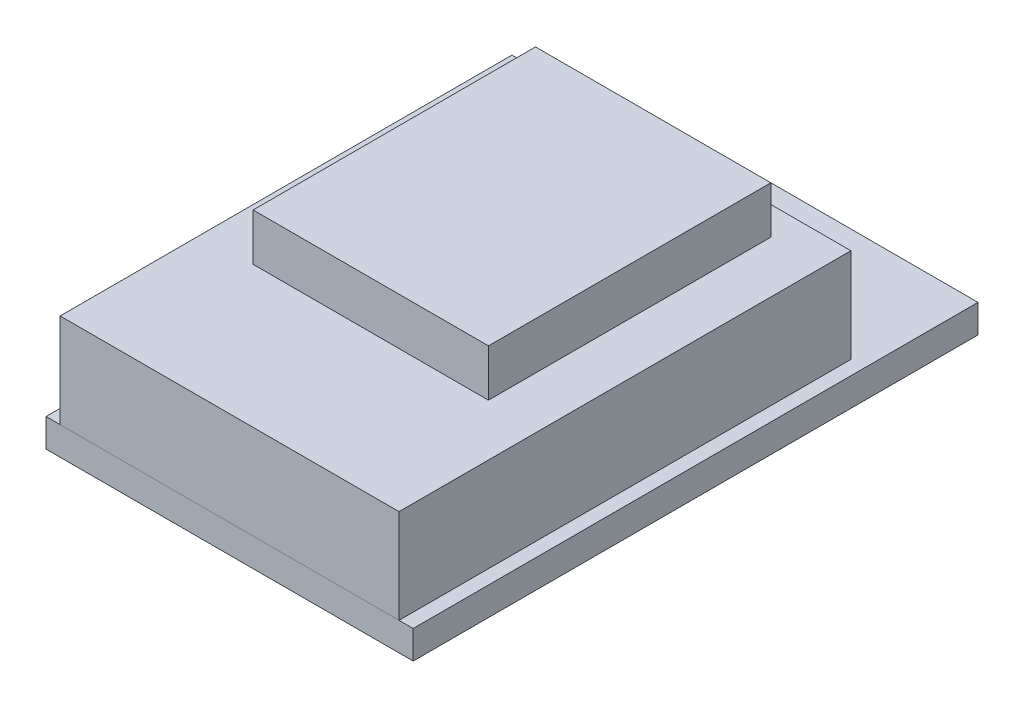
ISO-10303-21;
HEADER;
FILE_DESCRIPTION(('STEP AP214'),'2;1');
FILE_NAME('part.step','',(''),(''),'','','');
FILE_SCHEMA(('AUTOMOTIVE_DESIGN { 1 0 10303 214 1 1 1 1 }'));
ENDSEC;
DATA;
#1=APPLICATION_CONTEXT('core data for automotive mechanical design processes');
#2=APPLICATION_PROTOCOL_DEFINITION('international standard','automotive_design',2000,#1);
#3=PRODUCT_CONTEXT('',#1,'mechanical');
#4=PRODUCT('Part','Part','',(#3));
#5=PRODUCT_RELATED_PRODUCT_CATEGORY('part','',(#4));
#6=PRODUCT_DEFINITION_FORMATION('','',#4);
#7=PRODUCT_DEFINITION_CONTEXT('part definition',#1,'design');
#8=PRODUCT_DEFINITION('design','',#6,#7);
#9=PRODUCT_DEFINITION_SHAPE('','',#8);
#10=(LENGTH_UNIT() NAMED_UNIT(*) SI_UNIT(.MILLI.,.METRE.));
#11=(NAMED_UNIT(*) PLANE_ANGLE_UNIT() SI_UNIT($,.RADIAN.));
#12=(NAMED_UNIT(*) SI_UNIT($,.STERADIAN.) SOLID_ANGLE_UNIT());
#13=UNCERTAINTY_MEASURE_WITH_UNIT(LENGTH_MEASURE(1.E-05),#10,'distance_accuracy_value','');
#14=(GEOMETRIC_REPRESENTATION_CONTEXT(3) GLOBAL_UNCERTAINTY_ASSIGNED_CONTEXT((#13)) GLOBAL_UNIT_ASSIGNED_CONTEXT((#10,
#11,#12)) REPRESENTATION_CONTEXT('',''));
#15=CARTESIAN_POINT('',(0.,0.,0.));
#16=DIRECTION('',(0.,0.,1.));
#17=DIRECTION('',(1.,0.,0.));
#18=AXIS2_PLACEMENT_3D('',#15,#16,#17);
#19=CARTESIAN_POINT('',(-6.25,9.,7.5));
#20=DIRECTION('',(1.,0.,0.));
#21=DIRECTION('',(0.,0.,-1.));
#22=AXIS2_PLACEMENT_3D('',#19,#20,#21);
#23=PLANE('',#22);
#24=DIRECTION('',(0.,0.,1.));
#25=VECTOR('',#24,1.);
#26=CARTESIAN_POINT('',(-6.25,6.5,7.5));
#27=LINE('',#26,#25);
#28=CARTESIAN_POINT('',(-6.25,6.5,-7.5));
#29=VERTEX_POINT('',#28);
#30=CARTESIAN_POINT('',(-6.25,6.5,7.5));
#31=VERTEX_POINT('',#30);
#32=EDGE_CURVE('E109',#29,#31,#27,.T.);
#33=ORIENTED_EDGE('',*,*,#32,.T.);
#34=DIRECTION('',(0.,-1.,0.));
#35=VECTOR('',#34,1.);
#36=CARTESIAN_POINT('',(-6.25,9.,7.5));
#37=LINE('',#36,#35);
#38=CARTESIAN_POINT('',(-6.25,9.,7.5));
#39=VERTEX_POINT('',#38);
#40=EDGE_CURVE('E12',#39,#31,#37,.T.);
#41=ORIENTED_EDGE('',*,*,#40,.F.);
#42=DIRECTION('',(0.,0.,1.));
#43=VECTOR('',#42,1.);
#44=CARTESIAN_POINT('',(-6.25,9.,7.5));
#45=LINE('',#44,#43);
#46=CARTESIAN_POINT('',(-6.25,9.,-7.5));
#47=VERTEX_POINT('',#46);
#48=EDGE_CURVE('E97',#47,#39,#45,.T.);
#49=ORIENTED_EDGE('',*,*,#48,.F.);
#50=DIRECTION('',(0.,-1.,0.));
#51=VECTOR('',#50,1.);
#52=CARTESIAN_POINT('',(-6.25,9.,-7.5));
#53=LINE('',#52,#51);
#54=EDGE_CURVE('E105',#47,#29,#53,.T.);
#55=ORIENTED_EDGE('',*,*,#54,.T.);
#56=EDGE_LOOP('',(#33,#41,#49,#55));
#57=FACE_BOUND('',#56,.T.);
#58=ADVANCED_FACE('F46',(#57),#23,.F.);
#59=CARTESIAN_POINT('',(6.25,9.,7.5));
#60=DIRECTION('',(0.,0.,-1.));
#61=DIRECTION('',(-1.,0.,0.));
#62=AXIS2_PLACEMENT_3D('',#59,#60,#61);
#63=PLANE('',#62);
#64=DIRECTION('',(1.,0.,0.));
#65=VECTOR('',#64,1.);
#66=CARTESIAN_POINT('',(6.25,6.5,7.5));
#67=LINE('',#66,#65);
#68=CARTESIAN_POINT('',(6.25,6.5,7.5));
#69=VERTEX_POINT('',#68);
#70=EDGE_CURVE('E101',#31,#69,#67,.T.);
#71=ORIENTED_EDGE('',*,*,#70,.T.);
#72=DIRECTION('',(0.,-1.,0.));
#73=VECTOR('',#72,1.);
#74=CARTESIAN_POINT('',(6.25,9.,7.5));
#75=LINE('',#74,#73);
#76=CARTESIAN_POINT('',(6.25,9.,7.5));
#77=VERTEX_POINT('',#76);
#78=EDGE_CURVE('E54',#77,#69,#75,.T.);
#79=ORIENTED_EDGE('',*,*,#78,.F.);
#80=DIRECTION('',(1.,0.,0.));
#81=VECTOR('',#80,1.);
#82=CARTESIAN_POINT('',(6.25,9.,7.5));
#83=LINE('',#82,#81);
#84=EDGE_CURVE('E92',#39,#77,#83,.T.);
#85=ORIENTED_EDGE('',*,*,#84,.F.);
#86=ORIENTED_EDGE('',*,*,#40,.T.);
#87=EDGE_LOOP('',(#71,#79,#85,#86));
#88=FACE_BOUND('',#87,.T.);
#89=ADVANCED_FACE('F100',(#88),#63,.F.);
#90=CARTESIAN_POINT('',(6.25,9.,7.5));
#91=DIRECTION('',(-1.,0.,0.));
#92=DIRECTION('',(0.,0.,1.));
#93=AXIS2_PLACEMENT_3D('',#90,#91,#92);
#94=PLANE('',#93);
#95=DIRECTION('',(0.,0.,-1.));
#96=VECTOR('',#95,1.);
#97=CARTESIAN_POINT('',(6.25,6.5,7.5));
#98=LINE('',#97,#96);
#99=CARTESIAN_POINT('',(6.25,6.5,-7.5));
#100=VERTEX_POINT('',#99);
#101=EDGE_CURVE('E79',#69,#100,#98,.T.);
#102=ORIENTED_EDGE('',*,*,#101,.T.);
#103=DIRECTION('',(0.,-1.,0.));
#104=VECTOR('',#103,1.);
#105=CARTESIAN_POINT('',(6.25,9.,-7.5));
#106=LINE('',#105,#104);
#107=CARTESIAN_POINT('',(6.25,9.,-7.5));
#108=VERTEX_POINT('',#107);
#109=EDGE_CURVE('E102',#108,#100,#106,.T.);
#110=ORIENTED_EDGE('',*,*,#109,.F.);
#111=DIRECTION('',(0.,0.,-1.));
#112=VECTOR('',#111,1.);
#113=CARTESIAN_POINT('',(6.25,9.,7.5));
#114=LINE('',#113,#112);
#115=EDGE_CURVE('E95',#77,#108,#114,.T.);
#116=ORIENTED_EDGE('',*,*,#115,.F.);
#117=ORIENTED_EDGE('',*,*,#78,.T.);
#118=EDGE_LOOP('',(#102,#110,#116,#117));
#119=FACE_BOUND('',#118,.T.);
#120=ADVANCED_FACE('F103',(#119),#94,.F.);
#121=CARTESIAN_POINT('',(6.25,9.,-7.5));
#122=DIRECTION('',(0.,0.,1.));
#123=DIRECTION('',(1.,0.,0.));
#124=AXIS2_PLACEMENT_3D('',#121,#122,#123);
#125=PLANE('',#124);
#126=DIRECTION('',(-1.,0.,0.));
#127=VECTOR('',#126,1.);
#128=CARTESIAN_POINT('',(6.25,6.5,-7.5));
#129=LINE('',#128,#127);
#130=EDGE_CURVE('E85',#100,#29,#129,.T.);
#131=ORIENTED_EDGE('',*,*,#130,.T.);
#132=ORIENTED_EDGE('',*,*,#54,.F.);
#133=DIRECTION('',(-1.,0.,0.));
#134=VECTOR('',#133,1.);
#135=CARTESIAN_POINT('',(6.25,9.,-7.5));
#136=LINE('',#135,#134);
#137=EDGE_CURVE('E62',#108,#47,#136,.T.);
#138=ORIENTED_EDGE('',*,*,#137,.F.);
#139=ORIENTED_EDGE('',*,*,#109,.T.);
#140=EDGE_LOOP('',(#131,#132,#138,#139));
#141=FACE_BOUND('',#140,.T.);
#142=ADVANCED_FACE('F116',(#141),#125,.F.);
#143=CARTESIAN_POINT('',(0.,9.,0.));
#144=DIRECTION('',(0.,1.,0.));
#145=DIRECTION('',(0.,0.,1.));
#146=AXIS2_PLACEMENT_3D('',#143,#144,#145);
#147=PLANE('',#146);
#148=ORIENTED_EDGE('',*,*,#48,.T.);
#149=ORIENTED_EDGE('',*,*,#84,.T.);
#150=ORIENTED_EDGE('',*,*,#115,.T.);
#151=ORIENTED_EDGE('',*,*,#137,.T.);
#152=EDGE_LOOP('',(#148,#149,#150,#151));
#153=FACE_BOUND('',#152,.T.);
#154=ADVANCED_FACE('F93',(#153),#147,.T.);
#155=CARTESIAN_POINT('',(0.,6.5,0.));
#156=DIRECTION('',(0.,1.,0.));
#157=DIRECTION('',(0.,0.,1.));
#158=AXIS2_PLACEMENT_3D('',#155,#156,#157);
#159=PLANE('',#158);
#160=ORIENTED_EDGE('',*,*,#32,.F.);
#161=ORIENTED_EDGE('',*,*,#130,.F.);
#162=ORIENTED_EDGE('',*,*,#101,.F.);
#163=ORIENTED_EDGE('',*,*,#70,.F.);
#164=EDGE_LOOP('',(#160,#161,#162,#163));
#165=FACE_BOUND('',#164,.T.);
#166=ADVANCED_FACE('F119',(#165),#159,.F.);
#167=CLOSED_SHELL('',(#58,#89,#120,#142,#154,#166));
#168=MANIFOLD_SOLID_BREP('B2',#167);
#169=CARTESIAN_POINT('',(9.,6.5,-9.));
#170=DIRECTION('',(-1.,0.,0.));
#171=DIRECTION('',(0.,0.,1.));
#172=AXIS2_PLACEMENT_3D('',#169,#170,#171);
#173=PLANE('',#172);
#174=DIRECTION('',(0.,0.,-1.));
#175=VECTOR('',#174,1.);
#176=CARTESIAN_POINT('',(9.,1.5,-9.));
#177=LINE('',#176,#175);
#178=CARTESIAN_POINT('',(9.00000000000001,1.5,15.));
#179=VERTEX_POINT('',#178);
#180=CARTESIAN_POINT('',(9.,1.5,-9.));
#181=VERTEX_POINT('',#180);
#182=EDGE_CURVE('E243',#179,#181,#177,.T.);
#183=ORIENTED_EDGE('',*,*,#182,.T.);
#184=DIRECTION('',(0.,-1.,0.));
#185=VECTOR('',#184,1.);
#186=CARTESIAN_POINT('',(9.,6.5,-9.));
#187=LINE('',#186,#185);
#188=CARTESIAN_POINT('',(9.,6.5,-9.));
#189=VERTEX_POINT('',#188);
#190=EDGE_CURVE('E44',#189,#181,#187,.T.);
#191=ORIENTED_EDGE('',*,*,#190,.F.);
#192=DIRECTION('',(0.,0.,-1.));
#193=VECTOR('',#192,1.);
#194=CARTESIAN_POINT('',(9.,6.5,-9.));
#195=LINE('',#194,#193);
#196=CARTESIAN_POINT('',(9.00000000000001,6.5,15.));
#197=VERTEX_POINT('',#196);
#198=EDGE_CURVE('E231',#197,#189,#195,.T.);
#199=ORIENTED_EDGE('',*,*,#198,.F.);
#200=DIRECTION('',(0.,-1.,0.));
#201=VECTOR('',#200,1.);
#202=CARTESIAN_POINT('',(9.00000000000001,6.5,15.));
#203=LINE('',#202,#201);
#204=EDGE_CURVE('E239',#197,#179,#203,.T.);
#205=ORIENTED_EDGE('',*,*,#204,.T.);
#206=EDGE_LOOP('',(#183,#191,#199,#205));
#207=FACE_BOUND('',#206,.T.);
#208=ADVANCED_FACE('F180',(#207),#173,.F.);
#209=CARTESIAN_POINT('',(-9.,6.5,-9.));
#210=DIRECTION('',(0.,0.,1.));
#211=DIRECTION('',(1.,0.,0.));
#212=AXIS2_PLACEMENT_3D('',#209,#210,#211);
#213=PLANE('',#212);
#214=DIRECTION('',(-1.,0.,0.));
#215=VECTOR('',#214,1.);
#216=CARTESIAN_POINT('',(-9.,1.5,-9.));
#217=LINE('',#216,#215);
#218=CARTESIAN_POINT('',(-9.,1.5,-9.));
#219=VERTEX_POINT('',#218);
#220=EDGE_CURVE('E235',#181,#219,#217,.T.);
#221=ORIENTED_EDGE('',*,*,#220,.T.);
#222=DIRECTION('',(0.,-1.,0.));
#223=VECTOR('',#222,1.);
#224=CARTESIAN_POINT('',(-9.,6.5,-9.));
#225=LINE('',#224,#223);
#226=CARTESIAN_POINT('',(-9.,6.5,-9.));
#227=VERTEX_POINT('',#226);
#228=EDGE_CURVE('E188',#227,#219,#225,.T.);
#229=ORIENTED_EDGE('',*,*,#228,.F.);
#230=DIRECTION('',(-1.,0.,0.));
#231=VECTOR('',#230,1.);
#232=CARTESIAN_POINT('',(-9.,6.5,-9.));
#233=LINE('',#232,#231);
#234=EDGE_CURVE('E226',#189,#227,#233,.T.);
#235=ORIENTED_EDGE('',*,*,#234,.F.);
#236=ORIENTED_EDGE('',*,*,#190,.T.);
#237=EDGE_LOOP('',(#221,#229,#235,#236));
#238=FACE_BOUND('',#237,.T.);
#239=ADVANCED_FACE('F234',(#238),#213,.F.);
#240=CARTESIAN_POINT('',(-9.,6.5,-9.));
#241=DIRECTION('',(1.,0.,0.));
#242=DIRECTION('',(0.,0.,-1.));
#243=AXIS2_PLACEMENT_3D('',#240,#241,#242);
#244=PLANE('',#243);
#245=DIRECTION('',(0.,0.,1.));
#246=VECTOR('',#245,1.);
#247=CARTESIAN_POINT('',(-9.,1.5,-9.));
#248=LINE('',#247,#246);
#249=CARTESIAN_POINT('',(-9.,1.5,15.));
#250=VERTEX_POINT('',#249);
#251=EDGE_CURVE('E213',#219,#250,#248,.T.);
#252=ORIENTED_EDGE('',*,*,#251,.T.);
#253=DIRECTION('',(0.,-1.,0.));
#254=VECTOR('',#253,1.);
#255=CARTESIAN_POINT('',(-9.,6.5,15.));
#256=LINE('',#255,#254);
#257=CARTESIAN_POINT('',(-9.,6.5,15.));
#258=VERTEX_POINT('',#257);
#259=EDGE_CURVE('E236',#258,#250,#256,.T.);
#260=ORIENTED_EDGE('',*,*,#259,.F.);
#261=DIRECTION('',(0.,0.,1.));
#262=VECTOR('',#261,1.);
#263=CARTESIAN_POINT('',(-9.,6.5,-9.));
#264=LINE('',#263,#262);
#265=EDGE_CURVE('E229',#227,#258,#264,.T.);
#266=ORIENTED_EDGE('',*,*,#265,.F.);
#267=ORIENTED_EDGE('',*,*,#228,.T.);
#268=EDGE_LOOP('',(#252,#260,#266,#267));
#269=FACE_BOUND('',#268,.T.);
#270=ADVANCED_FACE('F237',(#269),#244,.F.);
#271=CARTESIAN_POINT('',(-9.,6.5,15.));
#272=DIRECTION('',(0.,0.,-1.));
#273=DIRECTION('',(-1.,0.,0.));
#274=AXIS2_PLACEMENT_3D('',#271,#272,#273);
#275=PLANE('',#274);
#276=DIRECTION('',(1.,0.,0.));
#277=VECTOR('',#276,1.);
#278=CARTESIAN_POINT('',(-9.,1.5,15.));
#279=LINE('',#278,#277);
#280=EDGE_CURVE('E219',#250,#179,#279,.T.);
#281=ORIENTED_EDGE('',*,*,#280,.T.);
#282=ORIENTED_EDGE('',*,*,#204,.F.);
#283=DIRECTION('',(1.,0.,0.));
#284=VECTOR('',#283,1.);
#285=CARTESIAN_POINT('',(-9.,6.5,15.));
#286=LINE('',#285,#284);
#287=EDGE_CURVE('E196',#258,#197,#286,.T.);
#288=ORIENTED_EDGE('',*,*,#287,.F.);
#289=ORIENTED_EDGE('',*,*,#259,.T.);
#290=EDGE_LOOP('',(#281,#282,#288,#289));
#291=FACE_BOUND('',#290,.T.);
#292=ADVANCED_FACE('F250',(#291),#275,.F.);
#293=CARTESIAN_POINT('',(0.,6.5,0.));
#294=DIRECTION('',(0.,1.,0.));
#295=DIRECTION('',(0.,0.,1.));
#296=AXIS2_PLACEMENT_3D('',#293,#294,#295);
#297=PLANE('',#296);
#298=ORIENTED_EDGE('',*,*,#198,.T.);
#299=ORIENTED_EDGE('',*,*,#234,.T.);
#300=ORIENTED_EDGE('',*,*,#265,.T.);
#301=ORIENTED_EDGE('',*,*,#287,.T.);
#302=EDGE_LOOP('',(#298,#299,#300,#301));
#303=FACE_BOUND('',#302,.T.);
#304=ADVANCED_FACE('F227',(#303),#297,.T.);
#305=CARTESIAN_POINT('',(0.,1.5,0.));
#306=DIRECTION('',(0.,1.,0.));
#307=DIRECTION('',(0.,0.,1.));
#308=AXIS2_PLACEMENT_3D('',#305,#306,#307);
#309=PLANE('',#308);
#310=ORIENTED_EDGE('',*,*,#182,.F.);
#311=ORIENTED_EDGE('',*,*,#280,.F.);
#312=ORIENTED_EDGE('',*,*,#251,.F.);
#313=ORIENTED_EDGE('',*,*,#220,.F.);
#314=EDGE_LOOP('',(#310,#311,#312,#313));
#315=FACE_BOUND('',#314,.T.);
#316=ADVANCED_FACE('F253',(#315),#309,.F.);
#317=CLOSED_SHELL('',(#208,#239,#270,#292,#304,#316));
#318=MANIFOLD_SOLID_BREP('B6',#317);
#319=CARTESIAN_POINT('',(5.08,-2.54,11.19));
#320=DIRECTION('',(0.,0.,-1.));
#321=DIRECTION('',(-1.,0.,0.));
#322=AXIS2_PLACEMENT_3D('',#319,#320,#321);
#323=PLANE('',#322);
#324=DIRECTION('',(-1.,0.,0.));
#325=VECTOR('',#324,1.);
#326=CARTESIAN_POINT('',(5.08,0.,11.19));
#327=LINE('',#326,#325);
#328=CARTESIAN_POINT('',(5.08,0.,11.19));
#329=VERTEX_POINT('',#328);
#330=CARTESIAN_POINT('',(2.54,0.,11.19));
#331=VERTEX_POINT('',#330);
#332=EDGE_CURVE('E377',#329,#331,#327,.T.);
#333=ORIENTED_EDGE('',*,*,#332,.T.);
#334=DIRECTION('',(0.,1.,0.));
#335=VECTOR('',#334,1.);
#336=CARTESIAN_POINT('',(2.54,-2.54,11.19));
#337=LINE('',#336,#335);
#338=CARTESIAN_POINT('',(2.54,-2.54,11.19));
#339=VERTEX_POINT('',#338);
#340=EDGE_CURVE('E178',#339,#331,#337,.T.);
#341=ORIENTED_EDGE('',*,*,#340,.F.);
#342=DIRECTION('',(-1.,0.,0.));
#343=VECTOR('',#342,1.);
#344=CARTESIAN_POINT('',(5.08,-2.54,11.19));
#345=LINE('',#344,#343);
#346=CARTESIAN_POINT('',(5.08,-2.54,11.19));
#347=VERTEX_POINT('',#346);
#348=EDGE_CURVE('E365',#347,#339,#345,.T.);
#349=ORIENTED_EDGE('',*,*,#348,.F.);
#350=DIRECTION('',(0.,1.,0.));
#351=VECTOR('',#350,1.);
#352=CARTESIAN_POINT('',(5.08,-2.54,11.19));
#353=LINE('',#352,#351);
#354=EDGE_CURVE('E373',#347,#329,#353,.T.);
#355=ORIENTED_EDGE('',*,*,#354,.T.);
#356=EDGE_LOOP('',(#333,#341,#349,#355));
#357=FACE_BOUND('',#356,.T.);
#358=ADVANCED_FACE('F314',(#357),#323,.F.);
#359=CARTESIAN_POINT('',(2.54,-2.54,11.19));
#360=DIRECTION('',(1.,0.,0.));
#361=DIRECTION('',(0.,0.,-1.));
#362=AXIS2_PLACEMENT_3D('',#359,#360,#361);
#363=PLANE('',#362);
#364=DIRECTION('',(0.,0.,-1.));
#365=VECTOR('',#364,1.);
#366=CARTESIAN_POINT('',(2.54,0.,11.19));
#367=LINE('',#366,#365);
#368=CARTESIAN_POINT('',(2.54,0.,-9.12999999999998));
#369=VERTEX_POINT('',#368);
#370=EDGE_CURVE('E369',#331,#369,#367,.T.);
#371=ORIENTED_EDGE('',*,*,#370,.T.);
#372=DIRECTION('',(0.,1.,0.));
#373=VECTOR('',#372,1.);
#374=CARTESIAN_POINT('',(2.54,-2.54,-9.12999999999998));
#375=LINE('',#374,#373);
#376=CARTESIAN_POINT('',(2.54,-2.54,-9.12999999999998));
#377=VERTEX_POINT('',#376);
#378=EDGE_CURVE('E322',#377,#369,#375,.T.);
#379=ORIENTED_EDGE('',*,*,#378,.F.);
#380=DIRECTION('',(0.,0.,-1.));
#381=VECTOR('',#380,1.);
#382=CARTESIAN_POINT('',(2.54,-2.54,11.19));
#383=LINE('',#382,#381);
#384=EDGE_CURVE('E360',#339,#377,#383,.T.);
#385=ORIENTED_EDGE('',*,*,#384,.F.);
#386=ORIENTED_EDGE('',*,*,#340,.T.);
#387=EDGE_LOOP('',(#371,#379,#385,#386));
#388=FACE_BOUND('',#387,.T.);
#389=ADVANCED_FACE('F368',(#388),#363,.F.);
#390=CARTESIAN_POINT('',(5.08,-2.54,-9.12999999999998));
#391=DIRECTION('',(0.,0.,1.));
#392=DIRECTION('',(1.,0.,0.));
#393=AXIS2_PLACEMENT_3D('',#390,#391,#392);
#394=PLANE('',#393);
#395=DIRECTION('',(1.,0.,0.));
#396=VECTOR('',#395,1.);
#397=CARTESIAN_POINT('',(5.08,0.,-9.12999999999998));
#398=LINE('',#397,#396);
#399=CARTESIAN_POINT('',(5.08,0.,-9.12999999999998));
#400=VERTEX_POINT('',#399);
#401=EDGE_CURVE('E347',#369,#400,#398,.T.);
#402=ORIENTED_EDGE('',*,*,#401,.T.);
#403=DIRECTION('',(0.,1.,0.));
#404=VECTOR('',#403,1.);
#405=CARTESIAN_POINT('',(5.08,-2.54,-9.12999999999998));
#406=LINE('',#405,#404);
#407=CARTESIAN_POINT('',(5.08,-2.54,-9.12999999999998));
#408=VERTEX_POINT('',#407);
#409=EDGE_CURVE('E370',#408,#400,#406,.T.);
#410=ORIENTED_EDGE('',*,*,#409,.F.);
#411=DIRECTION('',(1.,0.,0.));
#412=VECTOR('',#411,1.);
#413=CARTESIAN_POINT('',(5.08,-2.54,-9.12999999999998));
#414=LINE('',#413,#412);
#415=EDGE_CURVE('E363',#377,#408,#414,.T.);
#416=ORIENTED_EDGE('',*,*,#415,.F.);
#417=ORIENTED_EDGE('',*,*,#378,.T.);
#418=EDGE_LOOP('',(#402,#410,#416,#417));
#419=FACE_BOUND('',#418,.T.);
#420=ADVANCED_FACE('F371',(#419),#394,.F.);
#421=CARTESIAN_POINT('',(5.08,-2.54,11.19));
#422=DIRECTION('',(-1.,0.,0.));
#423=DIRECTION('',(0.,0.,1.));
#424=AXIS2_PLACEMENT_3D('',#421,#422,#423);
#425=PLANE('',#424);
#426=DIRECTION('',(0.,0.,1.));
#427=VECTOR('',#426,1.);
#428=CARTESIAN_POINT('',(5.08,0.,11.19));
#429=LINE('',#428,#427);
#430=EDGE_CURVE('E353',#400,#329,#429,.T.);
#431=ORIENTED_EDGE('',*,*,#430,.T.);
#432=ORIENTED_EDGE('',*,*,#354,.F.);
#433=DIRECTION('',(0.,0.,1.));
#434=VECTOR('',#433,1.);
#435=CARTESIAN_POINT('',(5.08,-2.54,11.19));
#436=LINE('',#435,#434);
#437=EDGE_CURVE('E330',#408,#347,#436,.T.);
#438=ORIENTED_EDGE('',*,*,#437,.F.);
#439=ORIENTED_EDGE('',*,*,#409,.T.);
#440=EDGE_LOOP('',(#431,#432,#438,#439));
#441=FACE_BOUND('',#440,.T.);
#442=ADVANCED_FACE('F384',(#441),#425,.F.);
#443=CARTESIAN_POINT('',(0.,-2.54,0.));
#444=DIRECTION('',(0.,-1.,0.));
#445=DIRECTION('',(0.,0.,-1.));
#446=AXIS2_PLACEMENT_3D('',#443,#444,#445);
#447=PLANE('',#446);
#448=ORIENTED_EDGE('',*,*,#348,.T.);
#449=ORIENTED_EDGE('',*,*,#384,.T.);
#450=ORIENTED_EDGE('',*,*,#415,.T.);
#451=ORIENTED_EDGE('',*,*,#437,.T.);
#452=EDGE_LOOP('',(#448,#449,#450,#451));
#453=FACE_BOUND('',#452,.T.);
#454=ADVANCED_FACE('F361',(#453),#447,.T.);
#455=CARTESIAN_POINT('',(0.,0.,0.));
#456=DIRECTION('',(0.,-1.,0.));
#457=DIRECTION('',(0.,0.,-1.));
#458=AXIS2_PLACEMENT_3D('',#455,#456,#457);
#459=PLANE('',#458);
#460=ORIENTED_EDGE('',*,*,#332,.F.);
#461=ORIENTED_EDGE('',*,*,#430,.F.);
#462=ORIENTED_EDGE('',*,*,#401,.F.);
#463=ORIENTED_EDGE('',*,*,#370,.F.);
#464=EDGE_LOOP('',(#460,#461,#462,#463));
#465=FACE_BOUND('',#464,.T.);
#466=ADVANCED_FACE('F387',(#465),#459,.F.);
#467=CLOSED_SHELL('',(#358,#389,#420,#442,#454,#466));
#468=MANIFOLD_SOLID_BREP('B38',#467);
#469=CARTESIAN_POINT('',(-5.08,-2.54,11.19));
#470=DIRECTION('',(1.,0.,0.));
#471=DIRECTION('',(0.,0.,-1.));
#472=AXIS2_PLACEMENT_3D('',#469,#470,#471);
#473=PLANE('',#472);
#474=DIRECTION('',(0.,0.,-1.));
#475=VECTOR('',#474,1.);
#476=CARTESIAN_POINT('',(-5.08,0.,11.19));
#477=LINE('',#476,#475);
#478=CARTESIAN_POINT('',(-5.08,0.,11.19));
#479=VERTEX_POINT('',#478);
#480=CARTESIAN_POINT('',(-5.08,0.,-9.13));
#481=VERTEX_POINT('',#480);
#482=EDGE_CURVE('E510',#479,#481,#477,.T.);
#483=ORIENTED_EDGE('',*,*,#482,.T.);
#484=DIRECTION('',(0.,1.,0.));
#485=VECTOR('',#484,1.);
#486=CARTESIAN_POINT('',(-5.08,-2.54,-9.13));
#487=LINE('',#486,#485);
#488=CARTESIAN_POINT('',(-5.08,-2.54,-9.13));
#489=VERTEX_POINT('',#488);
#490=EDGE_CURVE('E312',#489,#481,#487,.T.);
#491=ORIENTED_EDGE('',*,*,#490,.F.);
#492=DIRECTION('',(0.,0.,-1.));
#493=VECTOR('',#492,1.);
#494=CARTESIAN_POINT('',(-5.08,-2.54,11.19));
#495=LINE('',#494,#493);
#496=CARTESIAN_POINT('',(-5.08,-2.54,11.19));
#497=VERTEX_POINT('',#496);
#498=EDGE_CURVE('E498',#497,#489,#495,.T.);
#499=ORIENTED_EDGE('',*,*,#498,.F.);
#500=DIRECTION('',(0.,1.,0.));
#501=VECTOR('',#500,1.);
#502=CARTESIAN_POINT('',(-5.08,-2.54,11.19));
#503=LINE('',#502,#501);
#504=EDGE_CURVE('E506',#497,#479,#503,.T.);
#505=ORIENTED_EDGE('',*,*,#504,.T.);
#506=EDGE_LOOP('',(#483,#491,#499,#505));
#507=FACE_BOUND('',#506,.T.);
#508=ADVANCED_FACE('F447',(#507),#473,.F.);
#509=CARTESIAN_POINT('',(-5.08,-2.54,-9.13));
#510=DIRECTION('',(0.,0.,1.));
#511=DIRECTION('',(1.,0.,0.));
#512=AXIS2_PLACEMENT_3D('',#509,#510,#511);
#513=PLANE('',#512);
#514=DIRECTION('',(1.,0.,0.));
#515=VECTOR('',#514,1.);
#516=CARTESIAN_POINT('',(-5.08,0.,-9.13));
#517=LINE('',#516,#515);
#518=CARTESIAN_POINT('',(-2.54,0.,-9.13));
#519=VERTEX_POINT('',#518);
#520=EDGE_CURVE('E502',#481,#519,#517,.T.);
#521=ORIENTED_EDGE('',*,*,#520,.T.);
#522=DIRECTION('',(0.,1.,0.));
#523=VECTOR('',#522,1.);
#524=CARTESIAN_POINT('',(-2.54,-2.54,-9.13));
#525=LINE('',#524,#523);
#526=CARTESIAN_POINT('',(-2.54,-2.54,-9.13));
#527=VERTEX_POINT('',#526);
#528=EDGE_CURVE('E455',#527,#519,#525,.T.);
#529=ORIENTED_EDGE('',*,*,#528,.F.);
#530=DIRECTION('',(1.,0.,0.));
#531=VECTOR('',#530,1.);
#532=CARTESIAN_POINT('',(-5.08,-2.54,-9.13));
#533=LINE('',#532,#531);
#534=EDGE_CURVE('E493',#489,#527,#533,.T.);
#535=ORIENTED_EDGE('',*,*,#534,.F.);
#536=ORIENTED_EDGE('',*,*,#490,.T.);
#537=EDGE_LOOP('',(#521,#529,#535,#536));
#538=FACE_BOUND('',#537,.T.);
#539=ADVANCED_FACE('F501',(#538),#513,.F.);
#540=CARTESIAN_POINT('',(-2.54,-2.54,11.19));
#541=DIRECTION('',(-1.,0.,0.));
#542=DIRECTION('',(0.,0.,1.));
#543=AXIS2_PLACEMENT_3D('',#540,#541,#542);
#544=PLANE('',#543);
#545=DIRECTION('',(0.,0.,1.));
#546=VECTOR('',#545,1.);
#547=CARTESIAN_POINT('',(-2.54,0.,11.19));
#548=LINE('',#547,#546);
#549=CARTESIAN_POINT('',(-2.54,0.,11.19));
#550=VERTEX_POINT('',#549);
#551=EDGE_CURVE('E480',#519,#550,#548,.T.);
#552=ORIENTED_EDGE('',*,*,#551,.T.);
#553=DIRECTION('',(0.,1.,0.));
#554=VECTOR('',#553,1.);
#555=CARTESIAN_POINT('',(-2.54,-2.54,11.19));
#556=LINE('',#555,#554);
#557=CARTESIAN_POINT('',(-2.54,-2.54,11.19));
#558=VERTEX_POINT('',#557);
#559=EDGE_CURVE('E503',#558,#550,#556,.T.);
#560=ORIENTED_EDGE('',*,*,#559,.F.);
#561=DIRECTION('',(0.,0.,1.));
#562=VECTOR('',#561,1.);
#563=CARTESIAN_POINT('',(-2.54,-2.54,11.19));
#564=LINE('',#563,#562);
#565=EDGE_CURVE('E496',#527,#558,#564,.T.);
#566=ORIENTED_EDGE('',*,*,#565,.F.);
#567=ORIENTED_EDGE('',*,*,#528,.T.);
#568=EDGE_LOOP('',(#552,#560,#566,#567));
#569=FACE_BOUND('',#568,.T.);
#570=ADVANCED_FACE('F504',(#569),#544,.F.);
#571=CARTESIAN_POINT('',(-5.08,-2.54,11.19));
#572=DIRECTION('',(0.,0.,-1.));
#573=DIRECTION('',(-1.,0.,0.));
#574=AXIS2_PLACEMENT_3D('',#571,#572,#573);
#575=PLANE('',#574);
#576=DIRECTION('',(-1.,0.,0.));
#577=VECTOR('',#576,1.);
#578=CARTESIAN_POINT('',(-5.08,0.,11.19));
#579=LINE('',#578,#577);
#580=EDGE_CURVE('E486',#550,#479,#579,.T.);
#581=ORIENTED_EDGE('',*,*,#580,.T.);
#582=ORIENTED_EDGE('',*,*,#504,.F.);
#583=DIRECTION('',(-1.,0.,0.));
#584=VECTOR('',#583,1.);
#585=CARTESIAN_POINT('',(-5.08,-2.54,11.19));
#586=LINE('',#585,#584);
#587=EDGE_CURVE('E463',#558,#497,#586,.T.);
#588=ORIENTED_EDGE('',*,*,#587,.F.);
#589=ORIENTED_EDGE('',*,*,#559,.T.);
#590=EDGE_LOOP('',(#581,#582,#588,#589));
#591=FACE_BOUND('',#590,.T.);
#592=ADVANCED_FACE('F517',(#591),#575,.F.);
#593=CARTESIAN_POINT('',(0.,-2.54,0.));
#594=DIRECTION('',(0.,-1.,0.));
#595=DIRECTION('',(0.,0.,-1.));
#596=AXIS2_PLACEMENT_3D('',#593,#594,#595);
#597=PLANE('',#596);
#598=ORIENTED_EDGE('',*,*,#498,.T.);
#599=ORIENTED_EDGE('',*,*,#534,.T.);
#600=ORIENTED_EDGE('',*,*,#565,.T.);
#601=ORIENTED_EDGE('',*,*,#587,.T.);
#602=EDGE_LOOP('',(#598,#599,#600,#601));
#603=FACE_BOUND('',#602,.T.);
#604=ADVANCED_FACE('F494',(#603),#597,.T.);
#605=CARTESIAN_POINT('',(0.,0.,0.));
#606=DIRECTION('',(0.,-1.,0.));
#607=DIRECTION('',(0.,0.,-1.));
#608=AXIS2_PLACEMENT_3D('',#605,#606,#607);
#609=PLANE('',#608);
#610=ORIENTED_EDGE('',*,*,#482,.F.);
#611=ORIENTED_EDGE('',*,*,#580,.F.);
#612=ORIENTED_EDGE('',*,*,#551,.F.);
#613=ORIENTED_EDGE('',*,*,#520,.F.);
#614=EDGE_LOOP('',(#610,#611,#612,#613));
#615=FACE_BOUND('',#614,.T.);
#616=ADVANCED_FACE('F520',(#615),#609,.F.);
#617=CLOSED_SHELL('',(#508,#539,#570,#592,#604,#616));
#618=MANIFOLD_SOLID_BREP('B172',#617);
#619=CARTESIAN_POINT('',(9.75,1.5,15.));
#620=DIRECTION('',(-1.,0.,0.));
#621=DIRECTION('',(0.,0.,1.));
#622=AXIS2_PLACEMENT_3D('',#619,#620,#621);
#623=PLANE('',#622);
#624=DIRECTION('',(0.,0.,-1.));
#625=VECTOR('',#624,1.);
#626=CARTESIAN_POINT('',(9.75,0.,15.));
#627=LINE('',#626,#625);
#628=CARTESIAN_POINT('',(9.75,0.,15.));
#629=VERTEX_POINT('',#628);
#630=CARTESIAN_POINT('',(9.75,0.,-15.));
#631=VERTEX_POINT('',#630);
#632=EDGE_CURVE('E634',#629,#631,#627,.T.);
#633=ORIENTED_EDGE('',*,*,#632,.T.);
#634=DIRECTION('',(0.,-1.,0.));
#635=VECTOR('',#634,1.);
#636=CARTESIAN_POINT('',(9.75,1.5,-15.));
#637=LINE('',#636,#635);
#638=CARTESIAN_POINT('',(9.75,1.5,-15.));
#639=VERTEX_POINT('',#638);
#640=EDGE_CURVE('E445',#639,#631,#637,.T.);
#641=ORIENTED_EDGE('',*,*,#640,.F.);
#642=DIRECTION('',(0.,0.,-1.));
#643=VECTOR('',#642,1.);
#644=CARTESIAN_POINT('',(9.75,1.5,15.));
#645=LINE('',#644,#643);
#646=CARTESIAN_POINT('',(9.75,1.5,15.));
#647=VERTEX_POINT('',#646);
#648=EDGE_CURVE('E622',#647,#639,#645,.T.);
#649=ORIENTED_EDGE('',*,*,#648,.F.);
#650=DIRECTION('',(0.,-1.,0.));
#651=VECTOR('',#650,1.);
#652=CARTESIAN_POINT('',(9.75,1.5,15.));
#653=LINE('',#652,#651);
#654=EDGE_CURVE('E630',#647,#629,#653,.T.);
#655=ORIENTED_EDGE('',*,*,#654,.T.);
#656=EDGE_LOOP('',(#633,#641,#649,#655));
#657=FACE_BOUND('',#656,.T.);
#658=ADVANCED_FACE('F571',(#657),#623,.F.);
#659=CARTESIAN_POINT('',(-9.75,1.5,-15.));
#660=DIRECTION('',(0.,0.,1.));
#661=DIRECTION('',(1.,0.,0.));
#662=AXIS2_PLACEMENT_3D('',#659,#660,#661);
#663=PLANE('',#662);
#664=DIRECTION('',(-1.,0.,0.));
#665=VECTOR('',#664,1.);
#666=CARTESIAN_POINT('',(-9.75,0.,-15.));
#667=LINE('',#666,#665);
#668=CARTESIAN_POINT('',(-9.75,0.,-15.));
#669=VERTEX_POINT('',#668);
#670=EDGE_CURVE('E626',#631,#669,#667,.T.);
#671=ORIENTED_EDGE('',*,*,#670,.T.);
#672=DIRECTION('',(0.,-1.,0.));
#673=VECTOR('',#672,1.);
#674=CARTESIAN_POINT('',(-9.75,1.5,-15.));
#675=LINE('',#674,#673);
#676=CARTESIAN_POINT('',(-9.75,1.5,-15.));
#677=VERTEX_POINT('',#676);
#678=EDGE_CURVE('E579',#677,#669,#675,.T.);
#679=ORIENTED_EDGE('',*,*,#678,.F.);
#680=DIRECTION('',(-1.,0.,0.));
#681=VECTOR('',#680,1.);
#682=CARTESIAN_POINT('',(-9.75,1.5,-15.));
#683=LINE('',#682,#681);
#684=EDGE_CURVE('E617',#639,#677,#683,.T.);
#685=ORIENTED_EDGE('',*,*,#684,.F.);
#686=ORIENTED_EDGE('',*,*,#640,.T.);
#687=EDGE_LOOP('',(#671,#679,#685,#686));
#688=FACE_BOUND('',#687,.T.);
#689=ADVANCED_FACE('F625',(#688),#663,.F.);
#690=CARTESIAN_POINT('',(-9.75,1.5,15.));
#691=DIRECTION('',(1.,0.,0.));
#692=DIRECTION('',(0.,0.,-1.));
#693=AXIS2_PLACEMENT_3D('',#690,#691,#692);
#694=PLANE('',#693);
#695=DIRECTION('',(0.,0.,1.));
#696=VECTOR('',#695,1.);
#697=CARTESIAN_POINT('',(-9.75,0.,15.));
#698=LINE('',#697,#696);
#699=CARTESIAN_POINT('',(-9.75,0.,15.));
#700=VERTEX_POINT('',#699);
#701=EDGE_CURVE('E604',#669,#700,#698,.T.);
#702=ORIENTED_EDGE('',*,*,#701,.T.);
#703=DIRECTION('',(0.,-1.,0.));
#704=VECTOR('',#703,1.);
#705=CARTESIAN_POINT('',(-9.75,1.5,15.));
#706=LINE('',#705,#704);
#707=CARTESIAN_POINT('',(-9.75,1.5,15.));
#708=VERTEX_POINT('',#707);
#709=EDGE_CURVE('E627',#708,#700,#706,.T.);
#710=ORIENTED_EDGE('',*,*,#709,.F.);
#711=DIRECTION('',(0.,0.,1.));
#712=VECTOR('',#711,1.);
#713=CARTESIAN_POINT('',(-9.75,1.5,15.));
#714=LINE('',#713,#712);
#715=EDGE_CURVE('E620',#677,#708,#714,.T.);
#716=ORIENTED_EDGE('',*,*,#715,.F.);
#717=ORIENTED_EDGE('',*,*,#678,.T.);
#718=EDGE_LOOP('',(#702,#710,#716,#717));
#719=FACE_BOUND('',#718,.T.);
#720=ADVANCED_FACE('F628',(#719),#694,.F.);
#721=CARTESIAN_POINT('',(-9.75,1.5,15.));
#722=DIRECTION('',(0.,0.,-1.));
#723=DIRECTION('',(-1.,0.,0.));
#724=AXIS2_PLACEMENT_3D('',#721,#722,#723);
#725=PLANE('',#724);
#726=DIRECTION('',(1.,0.,0.));
#727=VECTOR('',#726,1.);
#728=CARTESIAN_POINT('',(-9.75,0.,15.));
#729=LINE('',#728,#727);
#730=EDGE_CURVE('E610',#700,#629,#729,.T.);
#731=ORIENTED_EDGE('',*,*,#730,.T.);
#732=ORIENTED_EDGE('',*,*,#654,.F.);
#733=DIRECTION('',(1.,0.,0.));
#734=VECTOR('',#733,1.);
#735=CARTESIAN_POINT('',(-9.75,1.5,15.));
#736=LINE('',#735,#734);
#737=EDGE_CURVE('E587',#708,#647,#736,.T.);
#738=ORIENTED_EDGE('',*,*,#737,.F.);
#739=ORIENTED_EDGE('',*,*,#709,.T.);
#740=EDGE_LOOP('',(#731,#732,#738,#739));
#741=FACE_BOUND('',#740,.T.);
#742=ADVANCED_FACE('F641',(#741),#725,.F.);
#743=CARTESIAN_POINT('',(0.,1.5,0.));
#744=DIRECTION('',(0.,-1.,0.));
#745=DIRECTION('',(0.,0.,-1.));
#746=AXIS2_PLACEMENT_3D('',#743,#744,#745);
#747=PLANE('',#746);
#748=ORIENTED_EDGE('',*,*,#648,.T.);
#749=ORIENTED_EDGE('',*,*,#684,.T.);
#750=ORIENTED_EDGE('',*,*,#715,.T.);
#751=ORIENTED_EDGE('',*,*,#737,.T.);
#752=EDGE_LOOP('',(#748,#749,#750,#751));
#753=FACE_BOUND('',#752,.T.);
#754=ADVANCED_FACE('F618',(#753),#747,.F.);
#755=CARTESIAN_POINT('',(0.,0.,0.));
#756=DIRECTION('',(0.,-1.,0.));
#757=DIRECTION('',(0.,0.,-1.));
#758=AXIS2_PLACEMENT_3D('',#755,#756,#757);
#759=PLANE('',#758);
#760=ORIENTED_EDGE('',*,*,#632,.F.);
#761=ORIENTED_EDGE('',*,*,#730,.F.);
#762=ORIENTED_EDGE('',*,*,#701,.F.);
#763=ORIENTED_EDGE('',*,*,#670,.F.);
#764=EDGE_LOOP('',(#760,#761,#762,#763));
#765=FACE_BOUND('',#764,.T.);
#766=ADVANCED_FACE('F644',(#765),#759,.T.);
#767=CLOSED_SHELL('',(#658,#689,#720,#742,#754,#766));
#768=MANIFOLD_SOLID_BREP('B306',#767);
#769=ADVANCED_BREP_SHAPE_REPRESENTATION('',(#18,#168,#318,#468,#618,#768),#14);
#770=SHAPE_DEFINITION_REPRESENTATION(#9,#769);
ENDSEC;
END-ISO-10303-21;
